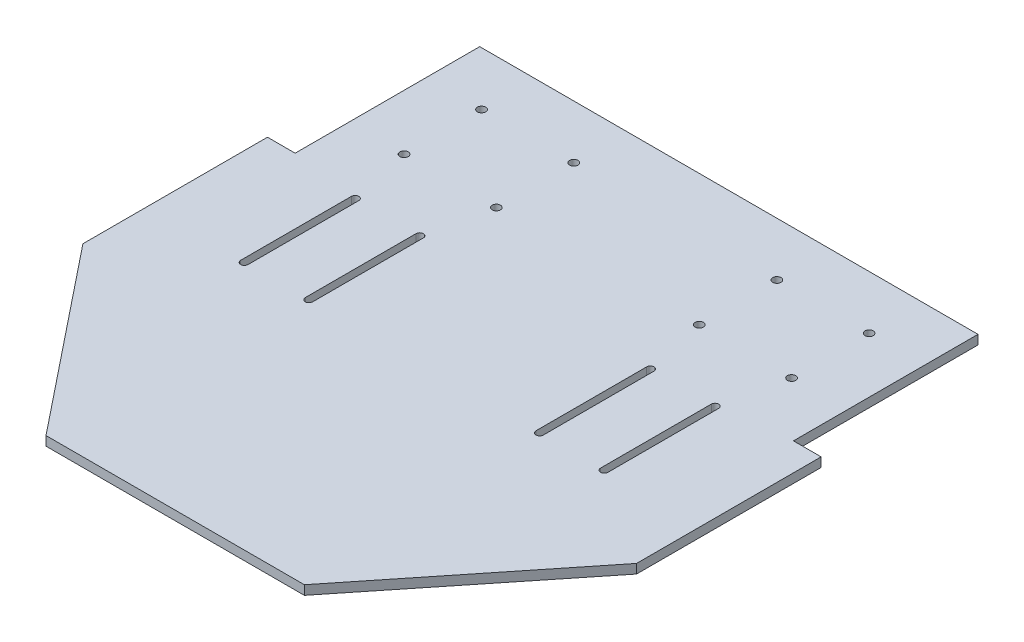
ISO-10303-21;
HEADER;
FILE_DESCRIPTION(('STEP AP214'),'2;1');
FILE_NAME('part.step','',(''),(''),'','','');
FILE_SCHEMA(('AUTOMOTIVE_DESIGN { 1 0 10303 214 1 1 1 1 }'));
ENDSEC;
DATA;
#1=APPLICATION_CONTEXT('core data for automotive mechanical design processes');
#2=APPLICATION_PROTOCOL_DEFINITION('international standard','automotive_design',2000,#1);
#3=PRODUCT_CONTEXT('',#1,'mechanical');
#4=PRODUCT('Part','Part','',(#3));
#5=PRODUCT_RELATED_PRODUCT_CATEGORY('part','',(#4));
#6=PRODUCT_DEFINITION_FORMATION('','',#4);
#7=PRODUCT_DEFINITION_CONTEXT('part definition',#1,'design');
#8=PRODUCT_DEFINITION('design','',#6,#7);
#9=PRODUCT_DEFINITION_SHAPE('','',#8);
#10=(LENGTH_UNIT() NAMED_UNIT(*) SI_UNIT(.MILLI.,.METRE.));
#11=(NAMED_UNIT(*) PLANE_ANGLE_UNIT() SI_UNIT($,.RADIAN.));
#12=(NAMED_UNIT(*) SI_UNIT($,.STERADIAN.) SOLID_ANGLE_UNIT());
#13=UNCERTAINTY_MEASURE_WITH_UNIT(LENGTH_MEASURE(1.E-05),#10,'distance_accuracy_value','');
#14=(GEOMETRIC_REPRESENTATION_CONTEXT(3) GLOBAL_UNCERTAINTY_ASSIGNED_CONTEXT((#13)) GLOBAL_UNIT_ASSIGNED_CONTEXT((#10,
#11,#12)) REPRESENTATION_CONTEXT('',''));
#15=CARTESIAN_POINT('',(0.,0.,0.));
#16=DIRECTION('',(0.,0.,1.));
#17=DIRECTION('',(1.,0.,0.));
#18=AXIS2_PLACEMENT_3D('',#15,#16,#17);
#19=CARTESIAN_POINT('',(0.,5.,0.));
#20=DIRECTION('',(0.,1.,0.));
#21=DIRECTION('',(0.,0.,1.));
#22=AXIS2_PLACEMENT_3D('',#19,#20,#21);
#23=PLANE('',#22);
#24=CARTESIAN_POINT('',(-62.5,5.,-45.));
#25=DIRECTION('',(0.,1.,0.));
#26=DIRECTION('',(0.,0.,-1.));
#27=AXIS2_PLACEMENT_3D('',#24,#25,#26);
#28=CIRCLE('',#27,2.00000000000003);
#29=CARTESIAN_POINT('',(-60.5,5.,-45.));
#30=VERTEX_POINT('',#29);
#31=CARTESIAN_POINT('',(-64.5,5.,-45.));
#32=VERTEX_POINT('',#31);
#33=EDGE_CURVE('E50',#30,#32,#28,.T.);
#34=ORIENTED_EDGE('',*,*,#33,.F.);
#35=DIRECTION('',(0.,0.,-1.));
#36=VECTOR('',#35,1.);
#37=CARTESIAN_POINT('',(-60.5,5.,-45.));
#38=LINE('',#37,#36);
#39=CARTESIAN_POINT('',(-60.5,5.,15.));
#40=VERTEX_POINT('',#39);
#41=EDGE_CURVE('E229',#40,#30,#38,.T.);
#42=ORIENTED_EDGE('',*,*,#41,.F.);
#43=CARTESIAN_POINT('',(-62.5,5.,15.));
#44=DIRECTION('',(0.,1.,0.));
#45=DIRECTION('',(0.,0.,-1.));
#46=AXIS2_PLACEMENT_3D('',#43,#44,#45);
#47=CIRCLE('',#46,2.00000000000002);
#48=CARTESIAN_POINT('',(-64.5,5.,15.));
#49=VERTEX_POINT('',#48);
#50=EDGE_CURVE('E232',#49,#40,#47,.T.);
#51=ORIENTED_EDGE('',*,*,#50,.F.);
#52=DIRECTION('',(0.,0.,1.));
#53=VECTOR('',#52,1.);
#54=CARTESIAN_POINT('',(-64.5,5.,-45.));
#55=LINE('',#54,#53);
#56=EDGE_CURVE('E238',#32,#49,#55,.T.);
#57=ORIENTED_EDGE('',*,*,#56,.F.);
#58=EDGE_LOOP('',(#34,#42,#51,#57));
#59=FACE_BOUND('',#58,.T.);
#60=CARTESIAN_POINT('',(97.5,5.,-45.));
#61=DIRECTION('',(0.,1.,0.));
#62=DIRECTION('',(0.,0.,-1.));
#63=AXIS2_PLACEMENT_3D('',#60,#61,#62);
#64=CIRCLE('',#63,2.00000000000003);
#65=CARTESIAN_POINT('',(99.5,5.,-45.));
#66=VERTEX_POINT('',#65);
#67=CARTESIAN_POINT('',(95.5,5.,-45.));
#68=VERTEX_POINT('',#67);
#69=EDGE_CURVE('E58',#66,#68,#64,.T.);
#70=ORIENTED_EDGE('',*,*,#69,.F.);
#71=DIRECTION('',(0.,0.,-1.));
#72=VECTOR('',#71,1.);
#73=CARTESIAN_POINT('',(99.5,5.,-45.));
#74=LINE('',#73,#72);
#75=CARTESIAN_POINT('',(99.5,5.,15.));
#76=VERTEX_POINT('',#75);
#77=EDGE_CURVE('E253',#76,#66,#74,.T.);
#78=ORIENTED_EDGE('',*,*,#77,.F.);
#79=CARTESIAN_POINT('',(97.5,5.,15.));
#80=DIRECTION('',(0.,1.,0.));
#81=DIRECTION('',(0.,0.,-1.));
#82=AXIS2_PLACEMENT_3D('',#79,#80,#81);
#83=CIRCLE('',#82,2.00000000000002);
#84=CARTESIAN_POINT('',(95.5,5.,15.));
#85=VERTEX_POINT('',#84);
#86=EDGE_CURVE('E268',#85,#76,#83,.T.);
#87=ORIENTED_EDGE('',*,*,#86,.F.);
#88=DIRECTION('',(0.,0.,1.));
#89=VECTOR('',#88,1.);
#90=CARTESIAN_POINT('',(95.5,5.,-45.));
#91=LINE('',#90,#89);
#92=EDGE_CURVE('E264',#68,#85,#91,.T.);
#93=ORIENTED_EDGE('',*,*,#92,.F.);
#94=EDGE_LOOP('',(#70,#78,#87,#93));
#95=FACE_BOUND('',#94,.T.);
#96=CARTESIAN_POINT('',(62.5,5.,-45.));
#97=DIRECTION('',(0.,1.,0.));
#98=DIRECTION('',(0.,0.,1.));
#99=AXIS2_PLACEMENT_3D('',#96,#97,#98);
#100=CIRCLE('',#99,2.00000000000003);
#101=CARTESIAN_POINT('',(64.5,5.,-45.));
#102=VERTEX_POINT('',#101);
#103=CARTESIAN_POINT('',(60.5,5.,-45.));
#104=VERTEX_POINT('',#103);
#105=EDGE_CURVE('E293',#102,#104,#100,.T.);
#106=ORIENTED_EDGE('',*,*,#105,.F.);
#107=DIRECTION('',(0.,0.,-1.));
#108=VECTOR('',#107,1.);
#109=CARTESIAN_POINT('',(64.5,5.,-45.));
#110=LINE('',#109,#108);
#111=CARTESIAN_POINT('',(64.5,5.,15.));
#112=VERTEX_POINT('',#111);
#113=EDGE_CURVE('E283',#112,#102,#110,.T.);
#114=ORIENTED_EDGE('',*,*,#113,.F.);
#115=CARTESIAN_POINT('',(62.5,5.,15.));
#116=DIRECTION('',(0.,1.,0.));
#117=DIRECTION('',(0.,0.,1.));
#118=AXIS2_PLACEMENT_3D('',#115,#116,#117);
#119=CIRCLE('',#118,2.00000000000002);
#120=CARTESIAN_POINT('',(60.5,5.,15.));
#121=VERTEX_POINT('',#120);
#122=EDGE_CURVE('E298',#121,#112,#119,.T.);
#123=ORIENTED_EDGE('',*,*,#122,.F.);
#124=DIRECTION('',(0.,0.,1.));
#125=VECTOR('',#124,1.);
#126=CARTESIAN_POINT('',(60.5,5.,-45.));
#127=LINE('',#126,#125);
#128=EDGE_CURVE('E295',#104,#121,#127,.T.);
#129=ORIENTED_EDGE('',*,*,#128,.F.);
#130=EDGE_LOOP('',(#106,#114,#123,#129));
#131=FACE_BOUND('',#130,.T.);
#132=CARTESIAN_POINT('',(-97.5,5.,-45.));
#133=DIRECTION('',(0.,1.,0.));
#134=DIRECTION('',(0.,0.,1.));
#135=AXIS2_PLACEMENT_3D('',#132,#133,#134);
#136=CIRCLE('',#135,2.00000000000003);
#137=CARTESIAN_POINT('',(-95.5,5.,-45.));
#138=VERTEX_POINT('',#137);
#139=CARTESIAN_POINT('',(-99.5,5.,-45.));
#140=VERTEX_POINT('',#139);
#141=EDGE_CURVE('E245',#138,#140,#136,.T.);
#142=ORIENTED_EDGE('',*,*,#141,.F.);
#143=DIRECTION('',(0.,0.,-1.));
#144=VECTOR('',#143,1.);
#145=CARTESIAN_POINT('',(-95.5,5.,-45.));
#146=LINE('',#145,#144);
#147=CARTESIAN_POINT('',(-95.5,5.,15.));
#148=VERTEX_POINT('',#147);
#149=EDGE_CURVE('E314',#148,#138,#146,.T.);
#150=ORIENTED_EDGE('',*,*,#149,.F.);
#151=CARTESIAN_POINT('',(-97.5,5.,15.));
#152=DIRECTION('',(0.,1.,0.));
#153=DIRECTION('',(0.,0.,1.));
#154=AXIS2_PLACEMENT_3D('',#151,#152,#153);
#155=CIRCLE('',#154,2.00000000000002);
#156=CARTESIAN_POINT('',(-99.5,5.,15.));
#157=VERTEX_POINT('',#156);
#158=EDGE_CURVE('E328',#157,#148,#155,.T.);
#159=ORIENTED_EDGE('',*,*,#158,.F.);
#160=DIRECTION('',(0.,0.,1.));
#161=VECTOR('',#160,1.);
#162=CARTESIAN_POINT('',(-99.5,5.,-45.));
#163=LINE('',#162,#161);
#164=EDGE_CURVE('E325',#140,#157,#163,.T.);
#165=ORIENTED_EDGE('',*,*,#164,.F.);
#166=EDGE_LOOP('',(#142,#150,#159,#165));
#167=FACE_BOUND('',#166,.T.);
#168=DIRECTION('',(1.,0.,0.));
#169=VECTOR('',#168,1.);
#170=CARTESIAN_POINT('',(150.,5.,-50.));
#171=LINE('',#170,#169);
#172=CARTESIAN_POINT('',(135.,5.,-50.));
#173=VERTEX_POINT('',#172);
#174=CARTESIAN_POINT('',(150.,5.,-50.));
#175=VERTEX_POINT('',#174);
#176=EDGE_CURVE('E346',#173,#175,#171,.T.);
#177=ORIENTED_EDGE('',*,*,#176,.F.);
#178=DIRECTION('',(0.,0.,1.));
#179=VECTOR('',#178,1.);
#180=CARTESIAN_POINT('',(135.,5.,-150.));
#181=LINE('',#180,#179);
#182=CARTESIAN_POINT('',(135.,5.,-150.));
#183=VERTEX_POINT('',#182);
#184=EDGE_CURVE('E335',#183,#173,#181,.T.);
#185=ORIENTED_EDGE('',*,*,#184,.F.);
#186=DIRECTION('',(-1.,0.,0.));
#187=VECTOR('',#186,1.);
#188=CARTESIAN_POINT('',(-150.,5.,-150.));
#189=LINE('',#188,#187);
#190=CARTESIAN_POINT('',(-135.,5.,-150.));
#191=VERTEX_POINT('',#190);
#192=EDGE_CURVE('E439',#183,#191,#189,.T.);
#193=ORIENTED_EDGE('',*,*,#192,.T.);
#194=DIRECTION('',(0.,0.,-1.));
#195=VECTOR('',#194,1.);
#196=CARTESIAN_POINT('',(-135.,5.,-150.));
#197=LINE('',#196,#195);
#198=CARTESIAN_POINT('',(-135.,5.,-50.));
#199=VERTEX_POINT('',#198);
#200=EDGE_CURVE('E364',#199,#191,#197,.T.);
#201=ORIENTED_EDGE('',*,*,#200,.F.);
#202=DIRECTION('',(1.,0.,0.));
#203=VECTOR('',#202,1.);
#204=CARTESIAN_POINT('',(-150.,5.,-50.));
#205=LINE('',#204,#203);
#206=CARTESIAN_POINT('',(-150.,5.,-50.));
#207=VERTEX_POINT('',#206);
#208=EDGE_CURVE('E356',#207,#199,#205,.T.);
#209=ORIENTED_EDGE('',*,*,#208,.F.);
#210=DIRECTION('',(0.,0.,1.));
#211=VECTOR('',#210,1.);
#212=CARTESIAN_POINT('',(-150.,5.,-150.));
#213=LINE('',#212,#211);
#214=CARTESIAN_POINT('',(-150.,5.,50.));
#215=VERTEX_POINT('',#214);
#216=EDGE_CURVE('E427',#207,#215,#213,.T.);
#217=ORIENTED_EDGE('',*,*,#216,.T.);
#218=DIRECTION('',(0.624695047554425,0.,0.78086880944303));
#219=VECTOR('',#218,1.);
#220=CARTESIAN_POINT('',(-150.,5.,50.));
#221=LINE('',#220,#219);
#222=CARTESIAN_POINT('',(-70.,5.,150.));
#223=VERTEX_POINT('',#222);
#224=EDGE_CURVE('E429',#215,#223,#221,.T.);
#225=ORIENTED_EDGE('',*,*,#224,.T.);
#226=DIRECTION('',(1.,0.,0.));
#227=VECTOR('',#226,1.);
#228=CARTESIAN_POINT('',(-70.,5.,150.));
#229=LINE('',#228,#227);
#230=CARTESIAN_POINT('',(70.,5.,150.));
#231=VERTEX_POINT('',#230);
#232=EDGE_CURVE('E432',#223,#231,#229,.T.);
#233=ORIENTED_EDGE('',*,*,#232,.T.);
#234=DIRECTION('',(0.624695047554424,0.,-0.78086880944303));
#235=VECTOR('',#234,1.);
#236=CARTESIAN_POINT('',(150.,5.,50.));
#237=LINE('',#236,#235);
#238=CARTESIAN_POINT('',(150.,5.,50.));
#239=VERTEX_POINT('',#238);
#240=EDGE_CURVE('E434',#231,#239,#237,.T.);
#241=ORIENTED_EDGE('',*,*,#240,.T.);
#242=DIRECTION('',(0.,0.,-1.));
#243=VECTOR('',#242,1.);
#244=CARTESIAN_POINT('',(150.,5.,-150.));
#245=LINE('',#244,#243);
#246=EDGE_CURVE('E436',#239,#175,#245,.T.);
#247=ORIENTED_EDGE('',*,*,#246,.T.);
#248=EDGE_LOOP('',(#177,#185,#193,#201,#209,#217,#225,#233,#241,#247));
#249=FACE_BOUND('',#248,.T.);
#250=CARTESIAN_POINT('',(105.,5.,-121.));
#251=DIRECTION('',(0.,1.,0.));
#252=DIRECTION('',(0.,0.,1.));
#253=AXIS2_PLACEMENT_3D('',#250,#251,#252);
#254=CIRCLE('',#253,2.25000000000001);
#255=CARTESIAN_POINT('',(105.,5.,-118.75));
#256=VERTEX_POINT('',#255);
#257=EDGE_CURVE('E385',#256,#256,#254,.T.);
#258=ORIENTED_EDGE('',*,*,#257,.F.);
#259=EDGE_LOOP('',(#258));
#260=FACE_BOUND('',#259,.T.);
#261=CARTESIAN_POINT('',(55.,5.,-121.));
#262=DIRECTION('',(0.,1.,0.));
#263=DIRECTION('',(0.,0.,1.));
#264=AXIS2_PLACEMENT_3D('',#261,#262,#263);
#265=CIRCLE('',#264,2.25);
#266=CARTESIAN_POINT('',(55.,5.,-118.75));
#267=VERTEX_POINT('',#266);
#268=EDGE_CURVE('E397',#267,#267,#265,.T.);
#269=ORIENTED_EDGE('',*,*,#268,.F.);
#270=EDGE_LOOP('',(#269));
#271=FACE_BOUND('',#270,.T.);
#272=CARTESIAN_POINT('',(-55.,5.,-79.));
#273=DIRECTION('',(0.,1.,0.));
#274=DIRECTION('',(0.,0.,1.));
#275=AXIS2_PLACEMENT_3D('',#272,#273,#274);
#276=CIRCLE('',#275,2.25);
#277=CARTESIAN_POINT('',(-55.,5.,-76.75));
#278=VERTEX_POINT('',#277);
#279=EDGE_CURVE('E409',#278,#278,#276,.T.);
#280=ORIENTED_EDGE('',*,*,#279,.F.);
#281=EDGE_LOOP('',(#280));
#282=FACE_BOUND('',#281,.T.);
#283=CARTESIAN_POINT('',(-105.,5.,-121.));
#284=DIRECTION('',(0.,1.,0.));
#285=DIRECTION('',(0.,0.,1.));
#286=AXIS2_PLACEMENT_3D('',#283,#284,#285);
#287=CIRCLE('',#286,2.25000000000001);
#288=CARTESIAN_POINT('',(-105.,5.,-118.75));
#289=VERTEX_POINT('',#288);
#290=EDGE_CURVE('E421',#289,#289,#287,.T.);
#291=ORIENTED_EDGE('',*,*,#290,.F.);
#292=EDGE_LOOP('',(#291));
#293=FACE_BOUND('',#292,.T.);
#294=CARTESIAN_POINT('',(-105.,5.,-79.));
#295=DIRECTION('',(0.,1.,0.));
#296=DIRECTION('',(0.,0.,1.));
#297=AXIS2_PLACEMENT_3D('',#294,#295,#296);
#298=CIRCLE('',#297,2.25000000000001);
#299=CARTESIAN_POINT('',(-105.,5.,-76.7499999999999));
#300=VERTEX_POINT('',#299);
#301=EDGE_CURVE('E415',#300,#300,#298,.T.);
#302=ORIENTED_EDGE('',*,*,#301,.F.);
#303=EDGE_LOOP('',(#302));
#304=FACE_BOUND('',#303,.T.);
#305=CARTESIAN_POINT('',(-55.,5.,-121.));
#306=DIRECTION('',(0.,1.,0.));
#307=DIRECTION('',(0.,0.,1.));
#308=AXIS2_PLACEMENT_3D('',#305,#306,#307);
#309=CIRCLE('',#308,2.25);
#310=CARTESIAN_POINT('',(-55.,5.,-118.75));
#311=VERTEX_POINT('',#310);
#312=EDGE_CURVE('E403',#311,#311,#309,.T.);
#313=ORIENTED_EDGE('',*,*,#312,.F.);
#314=EDGE_LOOP('',(#313));
#315=FACE_BOUND('',#314,.T.);
#316=CARTESIAN_POINT('',(55.,5.,-79.));
#317=DIRECTION('',(0.,1.,0.));
#318=DIRECTION('',(0.,0.,1.));
#319=AXIS2_PLACEMENT_3D('',#316,#317,#318);
#320=CIRCLE('',#319,2.25);
#321=CARTESIAN_POINT('',(55.,5.,-76.75));
#322=VERTEX_POINT('',#321);
#323=EDGE_CURVE('E391',#322,#322,#320,.T.);
#324=ORIENTED_EDGE('',*,*,#323,.F.);
#325=EDGE_LOOP('',(#324));
#326=FACE_BOUND('',#325,.T.);
#327=CARTESIAN_POINT('',(105.,5.,-79.));
#328=DIRECTION('',(0.,1.,0.));
#329=DIRECTION('',(0.,0.,1.));
#330=AXIS2_PLACEMENT_3D('',#327,#328,#329);
#331=CIRCLE('',#330,2.25000000000001);
#332=CARTESIAN_POINT('',(105.,5.,-76.75));
#333=VERTEX_POINT('',#332);
#334=EDGE_CURVE('E379',#333,#333,#331,.T.);
#335=ORIENTED_EDGE('',*,*,#334,.F.);
#336=EDGE_LOOP('',(#335));
#337=FACE_BOUND('',#336,.T.);
#338=ADVANCED_FACE('F35',(#59,#95,#131,#167,#249,#260,#271,#282,#293,#304,#315,#326,#337),#23,.T.);
#339=CARTESIAN_POINT('',(0.,0.,0.));
#340=DIRECTION('',(0.,1.,0.));
#341=DIRECTION('',(0.,0.,1.));
#342=AXIS2_PLACEMENT_3D('',#339,#340,#341);
#343=PLANE('',#342);
#344=DIRECTION('',(0.,0.,-1.));
#345=VECTOR('',#344,1.);
#346=CARTESIAN_POINT('',(-60.5,0.,-45.));
#347=LINE('',#346,#345);
#348=CARTESIAN_POINT('',(-60.5,0.,15.));
#349=VERTEX_POINT('',#348);
#350=CARTESIAN_POINT('',(-60.5,0.,-45.));
#351=VERTEX_POINT('',#350);
#352=EDGE_CURVE('E216',#349,#351,#347,.T.);
#353=ORIENTED_EDGE('',*,*,#352,.T.);
#354=CARTESIAN_POINT('',(-62.5,0.,-45.));
#355=DIRECTION('',(0.,1.,0.));
#356=DIRECTION('',(0.,0.,-1.));
#357=AXIS2_PLACEMENT_3D('',#354,#355,#356);
#358=CIRCLE('',#357,2.00000000000003);
#359=CARTESIAN_POINT('',(-64.5,0.,-45.));
#360=VERTEX_POINT('',#359);
#361=EDGE_CURVE('E210',#351,#360,#358,.T.);
#362=ORIENTED_EDGE('',*,*,#361,.T.);
#363=DIRECTION('',(0.,0.,1.));
#364=VECTOR('',#363,1.);
#365=CARTESIAN_POINT('',(-64.5,0.,-45.));
#366=LINE('',#365,#364);
#367=CARTESIAN_POINT('',(-64.5,0.,15.));
#368=VERTEX_POINT('',#367);
#369=EDGE_CURVE('E220',#360,#368,#366,.T.);
#370=ORIENTED_EDGE('',*,*,#369,.T.);
#371=CARTESIAN_POINT('',(-62.5,0.,15.));
#372=DIRECTION('',(0.,1.,0.));
#373=DIRECTION('',(0.,0.,-1.));
#374=AXIS2_PLACEMENT_3D('',#371,#372,#373);
#375=CIRCLE('',#374,2.00000000000002);
#376=EDGE_CURVE('E224',#368,#349,#375,.T.);
#377=ORIENTED_EDGE('',*,*,#376,.T.);
#378=EDGE_LOOP('',(#353,#362,#370,#377));
#379=FACE_BOUND('',#378,.T.);
#380=DIRECTION('',(0.,0.,-1.));
#381=VECTOR('',#380,1.);
#382=CARTESIAN_POINT('',(99.5,0.,-45.));
#383=LINE('',#382,#381);
#384=CARTESIAN_POINT('',(99.5,0.,15.));
#385=VERTEX_POINT('',#384);
#386=CARTESIAN_POINT('',(99.5,0.,-45.));
#387=VERTEX_POINT('',#386);
#388=EDGE_CURVE('E259',#385,#387,#383,.T.);
#389=ORIENTED_EDGE('',*,*,#388,.T.);
#390=CARTESIAN_POINT('',(97.5,0.,-45.));
#391=DIRECTION('',(0.,1.,0.));
#392=DIRECTION('',(0.,0.,-1.));
#393=AXIS2_PLACEMENT_3D('',#390,#391,#392);
#394=CIRCLE('',#393,2.00000000000003);
#395=CARTESIAN_POINT('',(95.5,0.,-45.));
#396=VERTEX_POINT('',#395);
#397=EDGE_CURVE('E249',#387,#396,#394,.T.);
#398=ORIENTED_EDGE('',*,*,#397,.T.);
#399=DIRECTION('',(0.,0.,1.));
#400=VECTOR('',#399,1.);
#401=CARTESIAN_POINT('',(95.5,0.,-45.));
#402=LINE('',#401,#400);
#403=CARTESIAN_POINT('',(95.5,0.,15.));
#404=VERTEX_POINT('',#403);
#405=EDGE_CURVE('E252',#396,#404,#402,.T.);
#406=ORIENTED_EDGE('',*,*,#405,.T.);
#407=CARTESIAN_POINT('',(97.5,0.,15.));
#408=DIRECTION('',(0.,1.,0.));
#409=DIRECTION('',(0.,0.,-1.));
#410=AXIS2_PLACEMENT_3D('',#407,#408,#409);
#411=CIRCLE('',#410,2.00000000000002);
#412=EDGE_CURVE('E256',#404,#385,#411,.T.);
#413=ORIENTED_EDGE('',*,*,#412,.T.);
#414=EDGE_LOOP('',(#389,#398,#406,#413));
#415=FACE_BOUND('',#414,.T.);
#416=DIRECTION('',(0.,0.,-1.));
#417=VECTOR('',#416,1.);
#418=CARTESIAN_POINT('',(64.5,0.,-45.));
#419=LINE('',#418,#417);
#420=CARTESIAN_POINT('',(64.5,0.,15.));
#421=VERTEX_POINT('',#420);
#422=CARTESIAN_POINT('',(64.5,0.,-45.));
#423=VERTEX_POINT('',#422);
#424=EDGE_CURVE('E289',#421,#423,#419,.T.);
#425=ORIENTED_EDGE('',*,*,#424,.T.);
#426=CARTESIAN_POINT('',(62.5,0.,-45.));
#427=DIRECTION('',(0.,1.,0.));
#428=DIRECTION('',(0.,0.,1.));
#429=AXIS2_PLACEMENT_3D('',#426,#427,#428);
#430=CIRCLE('',#429,2.00000000000003);
#431=CARTESIAN_POINT('',(60.5,0.,-45.));
#432=VERTEX_POINT('',#431);
#433=EDGE_CURVE('E279',#423,#432,#430,.T.);
#434=ORIENTED_EDGE('',*,*,#433,.T.);
#435=DIRECTION('',(0.,0.,1.));
#436=VECTOR('',#435,1.);
#437=CARTESIAN_POINT('',(60.5,0.,-45.));
#438=LINE('',#437,#436);
#439=CARTESIAN_POINT('',(60.5,0.,15.));
#440=VERTEX_POINT('',#439);
#441=EDGE_CURVE('E282',#432,#440,#438,.T.);
#442=ORIENTED_EDGE('',*,*,#441,.T.);
#443=CARTESIAN_POINT('',(62.5,0.,15.));
#444=DIRECTION('',(0.,1.,0.));
#445=DIRECTION('',(0.,0.,1.));
#446=AXIS2_PLACEMENT_3D('',#443,#444,#445);
#447=CIRCLE('',#446,2.00000000000002);
#448=EDGE_CURVE('E286',#440,#421,#447,.T.);
#449=ORIENTED_EDGE('',*,*,#448,.T.);
#450=EDGE_LOOP('',(#425,#434,#442,#449));
#451=FACE_BOUND('',#450,.T.);
#452=DIRECTION('',(0.,0.,-1.));
#453=VECTOR('',#452,1.);
#454=CARTESIAN_POINT('',(-95.5,0.,-45.));
#455=LINE('',#454,#453);
#456=CARTESIAN_POINT('',(-95.5,0.,15.));
#457=VERTEX_POINT('',#456);
#458=CARTESIAN_POINT('',(-95.5,0.,-45.));
#459=VERTEX_POINT('',#458);
#460=EDGE_CURVE('E320',#457,#459,#455,.T.);
#461=ORIENTED_EDGE('',*,*,#460,.T.);
#462=CARTESIAN_POINT('',(-97.5,0.,-45.));
#463=DIRECTION('',(0.,1.,0.));
#464=DIRECTION('',(0.,0.,1.));
#465=AXIS2_PLACEMENT_3D('',#462,#463,#464);
#466=CIRCLE('',#465,2.00000000000003);
#467=CARTESIAN_POINT('',(-99.5,0.,-45.));
#468=VERTEX_POINT('',#467);
#469=EDGE_CURVE('E310',#459,#468,#466,.T.);
#470=ORIENTED_EDGE('',*,*,#469,.T.);
#471=DIRECTION('',(0.,0.,1.));
#472=VECTOR('',#471,1.);
#473=CARTESIAN_POINT('',(-99.5,0.,-45.));
#474=LINE('',#473,#472);
#475=CARTESIAN_POINT('',(-99.5,0.,15.));
#476=VERTEX_POINT('',#475);
#477=EDGE_CURVE('E313',#468,#476,#474,.T.);
#478=ORIENTED_EDGE('',*,*,#477,.T.);
#479=CARTESIAN_POINT('',(-97.5,0.,15.));
#480=DIRECTION('',(0.,1.,0.));
#481=DIRECTION('',(0.,0.,1.));
#482=AXIS2_PLACEMENT_3D('',#479,#480,#481);
#483=CIRCLE('',#482,2.00000000000002);
#484=EDGE_CURVE('E317',#476,#457,#483,.T.);
#485=ORIENTED_EDGE('',*,*,#484,.T.);
#486=EDGE_LOOP('',(#461,#470,#478,#485));
#487=FACE_BOUND('',#486,.T.);
#488=DIRECTION('',(0.,0.,1.));
#489=VECTOR('',#488,1.);
#490=CARTESIAN_POINT('',(135.,0.,-150.));
#491=LINE('',#490,#489);
#492=CARTESIAN_POINT('',(135.,0.,-150.));
#493=VERTEX_POINT('',#492);
#494=CARTESIAN_POINT('',(135.,0.,-50.));
#495=VERTEX_POINT('',#494);
#496=EDGE_CURVE('E342',#493,#495,#491,.T.);
#497=ORIENTED_EDGE('',*,*,#496,.T.);
#498=DIRECTION('',(1.,0.,0.));
#499=VECTOR('',#498,1.);
#500=CARTESIAN_POINT('',(150.,0.,-50.));
#501=LINE('',#500,#499);
#502=CARTESIAN_POINT('',(150.,0.,-50.));
#503=VERTEX_POINT('',#502);
#504=EDGE_CURVE('E345',#495,#503,#501,.T.);
#505=ORIENTED_EDGE('',*,*,#504,.T.);
#506=DIRECTION('',(0.,0.,-1.));
#507=VECTOR('',#506,1.);
#508=CARTESIAN_POINT('',(150.,0.,-150.));
#509=LINE('',#508,#507);
#510=CARTESIAN_POINT('',(150.,0.,50.));
#511=VERTEX_POINT('',#510);
#512=EDGE_CURVE('E449',#511,#503,#509,.T.);
#513=ORIENTED_EDGE('',*,*,#512,.F.);
#514=DIRECTION('',(0.624695047554424,0.,-0.78086880944303));
#515=VECTOR('',#514,1.);
#516=CARTESIAN_POINT('',(150.,0.,50.));
#517=LINE('',#516,#515);
#518=CARTESIAN_POINT('',(70.,0.,150.));
#519=VERTEX_POINT('',#518);
#520=EDGE_CURVE('E447',#519,#511,#517,.T.);
#521=ORIENTED_EDGE('',*,*,#520,.F.);
#522=DIRECTION('',(1.,0.,0.));
#523=VECTOR('',#522,1.);
#524=CARTESIAN_POINT('',(-70.,0.,150.));
#525=LINE('',#524,#523);
#526=CARTESIAN_POINT('',(-70.,0.,150.));
#527=VERTEX_POINT('',#526);
#528=EDGE_CURVE('E445',#527,#519,#525,.T.);
#529=ORIENTED_EDGE('',*,*,#528,.F.);
#530=DIRECTION('',(0.624695047554425,0.,0.78086880944303));
#531=VECTOR('',#530,1.);
#532=CARTESIAN_POINT('',(-150.,0.,50.));
#533=LINE('',#532,#531);
#534=CARTESIAN_POINT('',(-150.,0.,50.));
#535=VERTEX_POINT('',#534);
#536=EDGE_CURVE('E443',#535,#527,#533,.T.);
#537=ORIENTED_EDGE('',*,*,#536,.F.);
#538=DIRECTION('',(0.,0.,1.));
#539=VECTOR('',#538,1.);
#540=CARTESIAN_POINT('',(-150.,0.,-150.));
#541=LINE('',#540,#539);
#542=CARTESIAN_POINT('',(-150.,0.,-50.));
#543=VERTEX_POINT('',#542);
#544=EDGE_CURVE('E424',#543,#535,#541,.T.);
#545=ORIENTED_EDGE('',*,*,#544,.F.);
#546=DIRECTION('',(1.,0.,0.));
#547=VECTOR('',#546,1.);
#548=CARTESIAN_POINT('',(-150.,0.,-50.));
#549=LINE('',#548,#547);
#550=CARTESIAN_POINT('',(-135.,0.,-50.));
#551=VERTEX_POINT('',#550);
#552=EDGE_CURVE('E360',#543,#551,#549,.T.);
#553=ORIENTED_EDGE('',*,*,#552,.T.);
#554=DIRECTION('',(0.,0.,-1.));
#555=VECTOR('',#554,1.);
#556=CARTESIAN_POINT('',(-135.,0.,-150.));
#557=LINE('',#556,#555);
#558=CARTESIAN_POINT('',(-135.,0.,-150.));
#559=VERTEX_POINT('',#558);
#560=EDGE_CURVE('E363',#551,#559,#557,.T.);
#561=ORIENTED_EDGE('',*,*,#560,.T.);
#562=DIRECTION('',(-1.,0.,0.));
#563=VECTOR('',#562,1.);
#564=CARTESIAN_POINT('',(-150.,0.,-150.));
#565=LINE('',#564,#563);
#566=EDGE_CURVE('E430',#493,#559,#565,.T.);
#567=ORIENTED_EDGE('',*,*,#566,.F.);
#568=EDGE_LOOP('',(#497,#505,#513,#521,#529,#537,#545,#553,#561,#567));
#569=FACE_BOUND('',#568,.T.);
#570=CARTESIAN_POINT('',(-105.,0.,-121.));
#571=DIRECTION('',(0.,1.,0.));
#572=DIRECTION('',(0.,0.,1.));
#573=AXIS2_PLACEMENT_3D('',#570,#571,#572);
#574=CIRCLE('',#573,2.25000000000001);
#575=CARTESIAN_POINT('',(-105.,0.,-118.75));
#576=VERTEX_POINT('',#575);
#577=EDGE_CURVE('E418',#576,#576,#574,.T.);
#578=ORIENTED_EDGE('',*,*,#577,.T.);
#579=EDGE_LOOP('',(#578));
#580=FACE_BOUND('',#579,.T.);
#581=CARTESIAN_POINT('',(-105.,0.,-79.));
#582=DIRECTION('',(0.,1.,0.));
#583=DIRECTION('',(0.,0.,1.));
#584=AXIS2_PLACEMENT_3D('',#581,#582,#583);
#585=CIRCLE('',#584,2.25000000000001);
#586=CARTESIAN_POINT('',(-105.,0.,-76.7499999999999));
#587=VERTEX_POINT('',#586);
#588=EDGE_CURVE('E412',#587,#587,#585,.T.);
#589=ORIENTED_EDGE('',*,*,#588,.T.);
#590=EDGE_LOOP('',(#589));
#591=FACE_BOUND('',#590,.T.);
#592=CARTESIAN_POINT('',(-55.,0.,-79.));
#593=DIRECTION('',(0.,1.,0.));
#594=DIRECTION('',(0.,0.,1.));
#595=AXIS2_PLACEMENT_3D('',#592,#593,#594);
#596=CIRCLE('',#595,2.25);
#597=CARTESIAN_POINT('',(-55.,0.,-76.75));
#598=VERTEX_POINT('',#597);
#599=EDGE_CURVE('E406',#598,#598,#596,.T.);
#600=ORIENTED_EDGE('',*,*,#599,.T.);
#601=EDGE_LOOP('',(#600));
#602=FACE_BOUND('',#601,.T.);
#603=CARTESIAN_POINT('',(-55.,0.,-121.));
#604=DIRECTION('',(0.,1.,0.));
#605=DIRECTION('',(0.,0.,1.));
#606=AXIS2_PLACEMENT_3D('',#603,#604,#605);
#607=CIRCLE('',#606,2.25);
#608=CARTESIAN_POINT('',(-55.,0.,-118.75));
#609=VERTEX_POINT('',#608);
#610=EDGE_CURVE('E400',#609,#609,#607,.T.);
#611=ORIENTED_EDGE('',*,*,#610,.T.);
#612=EDGE_LOOP('',(#611));
#613=FACE_BOUND('',#612,.T.);
#614=CARTESIAN_POINT('',(55.,0.,-121.));
#615=DIRECTION('',(0.,1.,0.));
#616=DIRECTION('',(0.,0.,1.));
#617=AXIS2_PLACEMENT_3D('',#614,#615,#616);
#618=CIRCLE('',#617,2.25);
#619=CARTESIAN_POINT('',(55.,0.,-118.75));
#620=VERTEX_POINT('',#619);
#621=EDGE_CURVE('E394',#620,#620,#618,.T.);
#622=ORIENTED_EDGE('',*,*,#621,.T.);
#623=EDGE_LOOP('',(#622));
#624=FACE_BOUND('',#623,.T.);
#625=CARTESIAN_POINT('',(55.,0.,-79.));
#626=DIRECTION('',(0.,1.,0.));
#627=DIRECTION('',(0.,0.,1.));
#628=AXIS2_PLACEMENT_3D('',#625,#626,#627);
#629=CIRCLE('',#628,2.25);
#630=CARTESIAN_POINT('',(55.,0.,-76.75));
#631=VERTEX_POINT('',#630);
#632=EDGE_CURVE('E388',#631,#631,#629,.T.);
#633=ORIENTED_EDGE('',*,*,#632,.T.);
#634=EDGE_LOOP('',(#633));
#635=FACE_BOUND('',#634,.T.);
#636=CARTESIAN_POINT('',(105.,0.,-121.));
#637=DIRECTION('',(0.,1.,0.));
#638=DIRECTION('',(0.,0.,1.));
#639=AXIS2_PLACEMENT_3D('',#636,#637,#638);
#640=CIRCLE('',#639,2.25000000000001);
#641=CARTESIAN_POINT('',(105.,0.,-118.75));
#642=VERTEX_POINT('',#641);
#643=EDGE_CURVE('E382',#642,#642,#640,.T.);
#644=ORIENTED_EDGE('',*,*,#643,.T.);
#645=EDGE_LOOP('',(#644));
#646=FACE_BOUND('',#645,.T.);
#647=CARTESIAN_POINT('',(105.,0.,-79.));
#648=DIRECTION('',(0.,1.,0.));
#649=DIRECTION('',(0.,0.,1.));
#650=AXIS2_PLACEMENT_3D('',#647,#648,#649);
#651=CIRCLE('',#650,2.25000000000001);
#652=CARTESIAN_POINT('',(105.,0.,-76.75));
#653=VERTEX_POINT('',#652);
#654=EDGE_CURVE('E375',#653,#653,#651,.T.);
#655=ORIENTED_EDGE('',*,*,#654,.T.);
#656=EDGE_LOOP('',(#655));
#657=FACE_BOUND('',#656,.T.);
#658=ADVANCED_FACE('F226',(#379,#415,#451,#487,#569,#580,#591,#602,#613,#624,#635,#646,#657),
#343,.F.);
#659=CARTESIAN_POINT('',(-150.,5.,-150.));
#660=DIRECTION('',(1.,0.,0.));
#661=DIRECTION('',(0.,0.,-1.));
#662=AXIS2_PLACEMENT_3D('',#659,#660,#661);
#663=PLANE('',#662);
#664=ORIENTED_EDGE('',*,*,#216,.F.);
#665=DIRECTION('',(0.,1.,0.));
#666=VECTOR('',#665,1.);
#667=CARTESIAN_POINT('',(-150.,0.,-50.));
#668=LINE('',#667,#666);
#669=EDGE_CURVE('E367',#543,#207,#668,.T.);
#670=ORIENTED_EDGE('',*,*,#669,.F.);
#671=ORIENTED_EDGE('',*,*,#544,.T.);
#672=DIRECTION('',(0.,-1.,0.));
#673=VECTOR('',#672,1.);
#674=CARTESIAN_POINT('',(-150.,5.,50.));
#675=LINE('',#674,#673);
#676=EDGE_CURVE('E11',#215,#535,#675,.T.);
#677=ORIENTED_EDGE('',*,*,#676,.F.);
#678=EDGE_LOOP('',(#664,#670,#671,#677));
#679=FACE_BOUND('',#678,.T.);
#680=ADVANCED_FACE('F37',(#679),#663,.F.);
#681=CARTESIAN_POINT('',(-150.,5.,50.));
#682=DIRECTION('',(0.78086880944303,0.,-0.624695047554425));
#683=DIRECTION('',(-0.624695047554425,0.,-0.78086880944303));
#684=AXIS2_PLACEMENT_3D('',#681,#682,#683);
#685=PLANE('',#684);
#686=ORIENTED_EDGE('',*,*,#536,.T.);
#687=DIRECTION('',(0.,-1.,0.));
#688=VECTOR('',#687,1.);
#689=CARTESIAN_POINT('',(-70.,5.,150.));
#690=LINE('',#689,#688);
#691=EDGE_CURVE('E43',#223,#527,#690,.T.);
#692=ORIENTED_EDGE('',*,*,#691,.F.);
#693=ORIENTED_EDGE('',*,*,#224,.F.);
#694=ORIENTED_EDGE('',*,*,#676,.T.);
#695=EDGE_LOOP('',(#686,#692,#693,#694));
#696=FACE_BOUND('',#695,.T.);
#697=ADVANCED_FACE('F486',(#696),#685,.F.);
#698=CARTESIAN_POINT('',(-70.,5.,150.));
#699=DIRECTION('',(0.,0.,-1.));
#700=DIRECTION('',(-1.,0.,0.));
#701=AXIS2_PLACEMENT_3D('',#698,#699,#700);
#702=PLANE('',#701);
#703=ORIENTED_EDGE('',*,*,#528,.T.);
#704=DIRECTION('',(0.,-1.,0.));
#705=VECTOR('',#704,1.);
#706=CARTESIAN_POINT('',(70.,5.,150.));
#707=LINE('',#706,#705);
#708=EDGE_CURVE('E455',#231,#519,#707,.T.);
#709=ORIENTED_EDGE('',*,*,#708,.F.);
#710=ORIENTED_EDGE('',*,*,#232,.F.);
#711=ORIENTED_EDGE('',*,*,#691,.T.);
#712=EDGE_LOOP('',(#703,#709,#710,#711));
#713=FACE_BOUND('',#712,.T.);
#714=ADVANCED_FACE('F462',(#713),#702,.F.);
#715=CARTESIAN_POINT('',(150.,5.,50.));
#716=DIRECTION('',(-0.78086880944303,0.,-0.624695047554424));
#717=DIRECTION('',(-0.624695047554424,0.,0.78086880944303));
#718=AXIS2_PLACEMENT_3D('',#715,#716,#717);
#719=PLANE('',#718);
#720=ORIENTED_EDGE('',*,*,#520,.T.);
#721=DIRECTION('',(0.,-1.,0.));
#722=VECTOR('',#721,1.);
#723=CARTESIAN_POINT('',(150.,5.,50.));
#724=LINE('',#723,#722);
#725=EDGE_CURVE('E441',#239,#511,#724,.T.);
#726=ORIENTED_EDGE('',*,*,#725,.F.);
#727=ORIENTED_EDGE('',*,*,#240,.F.);
#728=ORIENTED_EDGE('',*,*,#708,.T.);
#729=EDGE_LOOP('',(#720,#726,#727,#728));
#730=FACE_BOUND('',#729,.T.);
#731=ADVANCED_FACE('F474',(#730),#719,.F.);
#732=CARTESIAN_POINT('',(150.,5.,-150.));
#733=DIRECTION('',(-1.,0.,0.));
#734=DIRECTION('',(0.,0.,1.));
#735=AXIS2_PLACEMENT_3D('',#732,#733,#734);
#736=PLANE('',#735);
#737=ORIENTED_EDGE('',*,*,#512,.T.);
#738=DIRECTION('',(0.,1.,0.));
#739=VECTOR('',#738,1.);
#740=CARTESIAN_POINT('',(150.,0.,-50.));
#741=LINE('',#740,#739);
#742=EDGE_CURVE('E353',#503,#175,#741,.T.);
#743=ORIENTED_EDGE('',*,*,#742,.T.);
#744=ORIENTED_EDGE('',*,*,#246,.F.);
#745=ORIENTED_EDGE('',*,*,#725,.T.);
#746=EDGE_LOOP('',(#737,#743,#744,#745));
#747=FACE_BOUND('',#746,.T.);
#748=ADVANCED_FACE('F478',(#747),#736,.F.);
#749=CARTESIAN_POINT('',(-150.,5.,-150.));
#750=DIRECTION('',(0.,0.,1.));
#751=DIRECTION('',(1.,0.,0.));
#752=AXIS2_PLACEMENT_3D('',#749,#750,#751);
#753=PLANE('',#752);
#754=ORIENTED_EDGE('',*,*,#192,.F.);
#755=DIRECTION('',(0.,1.,0.));
#756=VECTOR('',#755,1.);
#757=CARTESIAN_POINT('',(135.,0.,-150.));
#758=LINE('',#757,#756);
#759=EDGE_CURVE('E349',#493,#183,#758,.T.);
#760=ORIENTED_EDGE('',*,*,#759,.F.);
#761=ORIENTED_EDGE('',*,*,#566,.T.);
#762=DIRECTION('',(0.,1.,0.));
#763=VECTOR('',#762,1.);
#764=CARTESIAN_POINT('',(-135.,0.,-150.));
#765=LINE('',#764,#763);
#766=EDGE_CURVE('E372',#559,#191,#765,.T.);
#767=ORIENTED_EDGE('',*,*,#766,.T.);
#768=EDGE_LOOP('',(#754,#760,#761,#767));
#769=FACE_BOUND('',#768,.T.);
#770=ADVANCED_FACE('F499',(#769),#753,.F.);
#771=CARTESIAN_POINT('',(-105.,5.,-121.));
#772=DIRECTION('',(0.,-1.,0.));
#773=DIRECTION('',(0.,0.,-1.));
#774=AXIS2_PLACEMENT_3D('',#771,#772,#773);
#775=CYLINDRICAL_SURFACE('',#774,2.25000000000001);
#776=ORIENTED_EDGE('',*,*,#290,.T.);
#777=EDGE_LOOP('',(#776));
#778=FACE_BOUND('',#777,.T.);
#779=ORIENTED_EDGE('',*,*,#577,.F.);
#780=EDGE_LOOP('',(#779));
#781=FACE_BOUND('',#780,.T.);
#782=ADVANCED_FACE('F525',(#778,#781),#775,.F.);
#783=CARTESIAN_POINT('',(-105.,5.,-79.));
#784=DIRECTION('',(0.,-1.,0.));
#785=DIRECTION('',(0.,0.,-1.));
#786=AXIS2_PLACEMENT_3D('',#783,#784,#785);
#787=CYLINDRICAL_SURFACE('',#786,2.25000000000001);
#788=ORIENTED_EDGE('',*,*,#301,.T.);
#789=EDGE_LOOP('',(#788));
#790=FACE_BOUND('',#789,.T.);
#791=ORIENTED_EDGE('',*,*,#588,.F.);
#792=EDGE_LOOP('',(#791));
#793=FACE_BOUND('',#792,.T.);
#794=ADVANCED_FACE('F797',(#790,#793),#787,.F.);
#795=CARTESIAN_POINT('',(-55.,5.,-79.));
#796=DIRECTION('',(0.,-1.,0.));
#797=DIRECTION('',(0.,0.,-1.));
#798=AXIS2_PLACEMENT_3D('',#795,#796,#797);
#799=CYLINDRICAL_SURFACE('',#798,2.25);
#800=ORIENTED_EDGE('',*,*,#279,.T.);
#801=EDGE_LOOP('',(#800));
#802=FACE_BOUND('',#801,.T.);
#803=ORIENTED_EDGE('',*,*,#599,.F.);
#804=EDGE_LOOP('',(#803));
#805=FACE_BOUND('',#804,.T.);
#806=ADVANCED_FACE('F806',(#802,#805),#799,.F.);
#807=CARTESIAN_POINT('',(-55.,5.,-121.));
#808=DIRECTION('',(0.,-1.,0.));
#809=DIRECTION('',(0.,0.,-1.));
#810=AXIS2_PLACEMENT_3D('',#807,#808,#809);
#811=CYLINDRICAL_SURFACE('',#810,2.25);
#812=ORIENTED_EDGE('',*,*,#312,.T.);
#813=EDGE_LOOP('',(#812));
#814=FACE_BOUND('',#813,.T.);
#815=ORIENTED_EDGE('',*,*,#610,.F.);
#816=EDGE_LOOP('',(#815));
#817=FACE_BOUND('',#816,.T.);
#818=ADVANCED_FACE('F815',(#814,#817),#811,.F.);
#819=CARTESIAN_POINT('',(55.,5.,-121.));
#820=DIRECTION('',(0.,-1.,0.));
#821=DIRECTION('',(0.,0.,-1.));
#822=AXIS2_PLACEMENT_3D('',#819,#820,#821);
#823=CYLINDRICAL_SURFACE('',#822,2.25);
#824=ORIENTED_EDGE('',*,*,#268,.T.);
#825=EDGE_LOOP('',(#824));
#826=FACE_BOUND('',#825,.T.);
#827=ORIENTED_EDGE('',*,*,#621,.F.);
#828=EDGE_LOOP('',(#827));
#829=FACE_BOUND('',#828,.T.);
#830=ADVANCED_FACE('F825',(#826,#829),#823,.F.);
#831=CARTESIAN_POINT('',(55.,5.,-79.));
#832=DIRECTION('',(0.,-1.,0.));
#833=DIRECTION('',(0.,0.,-1.));
#834=AXIS2_PLACEMENT_3D('',#831,#832,#833);
#835=CYLINDRICAL_SURFACE('',#834,2.25);
#836=ORIENTED_EDGE('',*,*,#323,.T.);
#837=EDGE_LOOP('',(#836));
#838=FACE_BOUND('',#837,.T.);
#839=ORIENTED_EDGE('',*,*,#632,.F.);
#840=EDGE_LOOP('',(#839));
#841=FACE_BOUND('',#840,.T.);
#842=ADVANCED_FACE('F835',(#838,#841),#835,.F.);
#843=CARTESIAN_POINT('',(105.,5.,-121.));
#844=DIRECTION('',(0.,-1.,0.));
#845=DIRECTION('',(0.,0.,-1.));
#846=AXIS2_PLACEMENT_3D('',#843,#844,#845);
#847=CYLINDRICAL_SURFACE('',#846,2.25000000000001);
#848=ORIENTED_EDGE('',*,*,#257,.T.);
#849=EDGE_LOOP('',(#848));
#850=FACE_BOUND('',#849,.T.);
#851=ORIENTED_EDGE('',*,*,#643,.F.);
#852=EDGE_LOOP('',(#851));
#853=FACE_BOUND('',#852,.T.);
#854=ADVANCED_FACE('F845',(#850,#853),#847,.F.);
#855=CARTESIAN_POINT('',(105.,5.,-79.));
#856=DIRECTION('',(0.,-1.,0.));
#857=DIRECTION('',(0.,0.,-1.));
#858=AXIS2_PLACEMENT_3D('',#855,#856,#857);
#859=CYLINDRICAL_SURFACE('',#858,2.25000000000001);
#860=ORIENTED_EDGE('',*,*,#334,.T.);
#861=EDGE_LOOP('',(#860));
#862=FACE_BOUND('',#861,.T.);
#863=ORIENTED_EDGE('',*,*,#654,.F.);
#864=EDGE_LOOP('',(#863));
#865=FACE_BOUND('',#864,.T.);
#866=ADVANCED_FACE('F757',(#862,#865),#859,.F.);
#867=CARTESIAN_POINT('',(-135.,0.,-150.));
#868=DIRECTION('',(1.,0.,0.));
#869=DIRECTION('',(0.,0.,-1.));
#870=AXIS2_PLACEMENT_3D('',#867,#868,#869);
#871=PLANE('',#870);
#872=ORIENTED_EDGE('',*,*,#200,.T.);
#873=ORIENTED_EDGE('',*,*,#766,.F.);
#874=ORIENTED_EDGE('',*,*,#560,.F.);
#875=DIRECTION('',(0.,1.,0.));
#876=VECTOR('',#875,1.);
#877=CARTESIAN_POINT('',(-135.,0.,-50.));
#878=LINE('',#877,#876);
#879=EDGE_CURVE('E376',#551,#199,#878,.T.);
#880=ORIENTED_EDGE('',*,*,#879,.T.);
#881=EDGE_LOOP('',(#872,#873,#874,#880));
#882=FACE_BOUND('',#881,.T.);
#883=ADVANCED_FACE('F496',(#882),#871,.F.);
#884=CARTESIAN_POINT('',(-150.,0.,-50.));
#885=DIRECTION('',(0.,0.,1.));
#886=DIRECTION('',(1.,0.,0.));
#887=AXIS2_PLACEMENT_3D('',#884,#885,#886);
#888=PLANE('',#887);
#889=ORIENTED_EDGE('',*,*,#208,.T.);
#890=ORIENTED_EDGE('',*,*,#879,.F.);
#891=ORIENTED_EDGE('',*,*,#552,.F.);
#892=ORIENTED_EDGE('',*,*,#669,.T.);
#893=EDGE_LOOP('',(#889,#890,#891,#892));
#894=FACE_BOUND('',#893,.T.);
#895=ADVANCED_FACE('F492',(#894),#888,.F.);
#896=CARTESIAN_POINT('',(150.,0.,-50.));
#897=DIRECTION('',(0.,0.,1.));
#898=DIRECTION('',(1.,0.,0.));
#899=AXIS2_PLACEMENT_3D('',#896,#897,#898);
#900=PLANE('',#899);
#901=ORIENTED_EDGE('',*,*,#176,.T.);
#902=ORIENTED_EDGE('',*,*,#742,.F.);
#903=ORIENTED_EDGE('',*,*,#504,.F.);
#904=DIRECTION('',(0.,1.,0.));
#905=VECTOR('',#904,1.);
#906=CARTESIAN_POINT('',(135.,0.,-50.));
#907=LINE('',#906,#905);
#908=EDGE_CURVE('E357',#495,#173,#907,.T.);
#909=ORIENTED_EDGE('',*,*,#908,.T.);
#910=EDGE_LOOP('',(#901,#902,#903,#909));
#911=FACE_BOUND('',#910,.T.);
#912=ADVANCED_FACE('F505',(#911),#900,.F.);
#913=CARTESIAN_POINT('',(135.,0.,-150.));
#914=DIRECTION('',(-1.,0.,0.));
#915=DIRECTION('',(0.,0.,1.));
#916=AXIS2_PLACEMENT_3D('',#913,#914,#915);
#917=PLANE('',#916);
#918=ORIENTED_EDGE('',*,*,#184,.T.);
#919=ORIENTED_EDGE('',*,*,#908,.F.);
#920=ORIENTED_EDGE('',*,*,#496,.F.);
#921=ORIENTED_EDGE('',*,*,#759,.T.);
#922=EDGE_LOOP('',(#918,#919,#920,#921));
#923=FACE_BOUND('',#922,.T.);
#924=ADVANCED_FACE('F503',(#923),#917,.F.);
#925=CARTESIAN_POINT('',(-97.5,0.,-45.));
#926=DIRECTION('',(0.,1.,0.));
#927=DIRECTION('',(0.,0.,1.));
#928=AXIS2_PLACEMENT_3D('',#925,#926,#927);
#929=CYLINDRICAL_SURFACE('',#928,2.00000000000003);
#930=ORIENTED_EDGE('',*,*,#141,.T.);
#931=DIRECTION('',(0.,1.,0.));
#932=VECTOR('',#931,1.);
#933=CARTESIAN_POINT('',(-99.5,0.,-45.));
#934=LINE('',#933,#932);
#935=EDGE_CURVE('E323',#468,#140,#934,.T.);
#936=ORIENTED_EDGE('',*,*,#935,.F.);
#937=ORIENTED_EDGE('',*,*,#469,.F.);
#938=DIRECTION('',(0.,1.,0.));
#939=VECTOR('',#938,1.);
#940=CARTESIAN_POINT('',(-95.5,0.,-45.));
#941=LINE('',#940,#939);
#942=EDGE_CURVE('E333',#459,#138,#941,.T.);
#943=ORIENTED_EDGE('',*,*,#942,.T.);
#944=EDGE_LOOP('',(#930,#936,#937,#943));
#945=FACE_BOUND('',#944,.T.);
#946=ADVANCED_FACE('F512',(#945),#929,.F.);
#947=CARTESIAN_POINT('',(-95.5,0.,-45.));
#948=DIRECTION('',(1.,0.,0.));
#949=DIRECTION('',(0.,0.,-1.));
#950=AXIS2_PLACEMENT_3D('',#947,#948,#949);
#951=PLANE('',#950);
#952=ORIENTED_EDGE('',*,*,#149,.T.);
#953=ORIENTED_EDGE('',*,*,#942,.F.);
#954=ORIENTED_EDGE('',*,*,#460,.F.);
#955=DIRECTION('',(0.,1.,0.));
#956=VECTOR('',#955,1.);
#957=CARTESIAN_POINT('',(-95.5,0.,15.));
#958=LINE('',#957,#956);
#959=EDGE_CURVE('E336',#457,#148,#958,.T.);
#960=ORIENTED_EDGE('',*,*,#959,.T.);
#961=EDGE_LOOP('',(#952,#953,#954,#960));
#962=FACE_BOUND('',#961,.T.);
#963=ADVANCED_FACE('F560',(#962),#951,.F.);
#964=CARTESIAN_POINT('',(-97.5,0.,15.));
#965=DIRECTION('',(0.,1.,0.));
#966=DIRECTION('',(0.,0.,1.));
#967=AXIS2_PLACEMENT_3D('',#964,#965,#966);
#968=CYLINDRICAL_SURFACE('',#967,2.00000000000002);
#969=ORIENTED_EDGE('',*,*,#158,.T.);
#970=ORIENTED_EDGE('',*,*,#959,.F.);
#971=ORIENTED_EDGE('',*,*,#484,.F.);
#972=DIRECTION('',(0.,1.,0.));
#973=VECTOR('',#972,1.);
#974=CARTESIAN_POINT('',(-99.5,0.,15.));
#975=LINE('',#974,#973);
#976=EDGE_CURVE('E338',#476,#157,#975,.T.);
#977=ORIENTED_EDGE('',*,*,#976,.T.);
#978=EDGE_LOOP('',(#969,#970,#971,#977));
#979=FACE_BOUND('',#978,.T.);
#980=ADVANCED_FACE('F570',(#979),#968,.F.);
#981=CARTESIAN_POINT('',(-99.5,0.,-45.));
#982=DIRECTION('',(-1.,0.,0.));
#983=DIRECTION('',(0.,0.,1.));
#984=AXIS2_PLACEMENT_3D('',#981,#982,#983);
#985=PLANE('',#984);
#986=ORIENTED_EDGE('',*,*,#164,.T.);
#987=ORIENTED_EDGE('',*,*,#976,.F.);
#988=ORIENTED_EDGE('',*,*,#477,.F.);
#989=ORIENTED_EDGE('',*,*,#935,.T.);
#990=EDGE_LOOP('',(#986,#987,#988,#989));
#991=FACE_BOUND('',#990,.T.);
#992=ADVANCED_FACE('F580',(#991),#985,.F.);
#993=CARTESIAN_POINT('',(62.5,0.,-45.));
#994=DIRECTION('',(0.,1.,0.));
#995=DIRECTION('',(0.,0.,1.));
#996=AXIS2_PLACEMENT_3D('',#993,#994,#995);
#997=CYLINDRICAL_SURFACE('',#996,2.00000000000003);
#998=ORIENTED_EDGE('',*,*,#105,.T.);
#999=DIRECTION('',(0.,1.,0.));
#1000=VECTOR('',#999,1.);
#1001=CARTESIAN_POINT('',(60.5,0.,-45.));
#1002=LINE('',#1001,#1000);
#1003=EDGE_CURVE('E292',#432,#104,#1002,.T.);
#1004=ORIENTED_EDGE('',*,*,#1003,.F.);
#1005=ORIENTED_EDGE('',*,*,#433,.F.);
#1006=DIRECTION('',(0.,1.,0.));
#1007=VECTOR('',#1006,1.);
#1008=CARTESIAN_POINT('',(64.5,0.,-45.));
#1009=LINE('',#1008,#1007);
#1010=EDGE_CURVE('E265',#423,#102,#1009,.T.);
#1011=ORIENTED_EDGE('',*,*,#1010,.T.);
#1012=EDGE_LOOP('',(#998,#1004,#1005,#1011));
#1013=FACE_BOUND('',#1012,.T.);
#1014=ADVANCED_FACE('F590',(#1013),#997,.F.);
#1015=CARTESIAN_POINT('',(64.5,0.,-45.));
#1016=DIRECTION('',(1.,0.,0.));
#1017=DIRECTION('',(0.,0.,-1.));
#1018=AXIS2_PLACEMENT_3D('',#1015,#1016,#1017);
#1019=PLANE('',#1018);
#1020=ORIENTED_EDGE('',*,*,#113,.T.);
#1021=ORIENTED_EDGE('',*,*,#1010,.F.);
#1022=ORIENTED_EDGE('',*,*,#424,.F.);
#1023=DIRECTION('',(0.,1.,0.));
#1024=VECTOR('',#1023,1.);
#1025=CARTESIAN_POINT('',(64.5,0.,15.));
#1026=LINE('',#1025,#1024);
#1027=EDGE_CURVE('E304',#421,#112,#1026,.T.);
#1028=ORIENTED_EDGE('',*,*,#1027,.T.);
#1029=EDGE_LOOP('',(#1020,#1021,#1022,#1028));
#1030=FACE_BOUND('',#1029,.T.);
#1031=ADVANCED_FACE('F600',(#1030),#1019,.F.);
#1032=CARTESIAN_POINT('',(62.5,0.,15.));
#1033=DIRECTION('',(0.,1.,0.));
#1034=DIRECTION('',(0.,0.,1.));
#1035=AXIS2_PLACEMENT_3D('',#1032,#1033,#1034);
#1036=CYLINDRICAL_SURFACE('',#1035,2.00000000000002);
#1037=ORIENTED_EDGE('',*,*,#122,.T.);
#1038=ORIENTED_EDGE('',*,*,#1027,.F.);
#1039=ORIENTED_EDGE('',*,*,#448,.F.);
#1040=DIRECTION('',(0.,1.,0.));
#1041=VECTOR('',#1040,1.);
#1042=CARTESIAN_POINT('',(60.5,0.,15.));
#1043=LINE('',#1042,#1041);
#1044=EDGE_CURVE('E306',#440,#121,#1043,.T.);
#1045=ORIENTED_EDGE('',*,*,#1044,.T.);
#1046=EDGE_LOOP('',(#1037,#1038,#1039,#1045));
#1047=FACE_BOUND('',#1046,.T.);
#1048=ADVANCED_FACE('F610',(#1047),#1036,.F.);
#1049=CARTESIAN_POINT('',(60.5,0.,-45.));
#1050=DIRECTION('',(-1.,0.,0.));
#1051=DIRECTION('',(0.,0.,1.));
#1052=AXIS2_PLACEMENT_3D('',#1049,#1050,#1051);
#1053=PLANE('',#1052);
#1054=ORIENTED_EDGE('',*,*,#128,.T.);
#1055=ORIENTED_EDGE('',*,*,#1044,.F.);
#1056=ORIENTED_EDGE('',*,*,#441,.F.);
#1057=ORIENTED_EDGE('',*,*,#1003,.T.);
#1058=EDGE_LOOP('',(#1054,#1055,#1056,#1057));
#1059=FACE_BOUND('',#1058,.T.);
#1060=ADVANCED_FACE('F620',(#1059),#1053,.F.);
#1061=CARTESIAN_POINT('',(97.5,0.,-45.));
#1062=DIRECTION('',(0.,1.,0.));
#1063=DIRECTION('',(0.,0.,1.));
#1064=AXIS2_PLACEMENT_3D('',#1061,#1062,#1063);
#1065=CYLINDRICAL_SURFACE('',#1064,2.00000000000003);
#1066=ORIENTED_EDGE('',*,*,#69,.T.);
#1067=DIRECTION('',(0.,1.,0.));
#1068=VECTOR('',#1067,1.);
#1069=CARTESIAN_POINT('',(95.5,0.,-45.));
#1070=LINE('',#1069,#1068);
#1071=EDGE_CURVE('E262',#396,#68,#1070,.T.);
#1072=ORIENTED_EDGE('',*,*,#1071,.F.);
#1073=ORIENTED_EDGE('',*,*,#397,.F.);
#1074=DIRECTION('',(0.,1.,0.));
#1075=VECTOR('',#1074,1.);
#1076=CARTESIAN_POINT('',(99.5,0.,-45.));
#1077=LINE('',#1076,#1075);
#1078=EDGE_CURVE('E239',#387,#66,#1077,.T.);
#1079=ORIENTED_EDGE('',*,*,#1078,.T.);
#1080=EDGE_LOOP('',(#1066,#1072,#1073,#1079));
#1081=FACE_BOUND('',#1080,.T.);
#1082=ADVANCED_FACE('F630',(#1081),#1065,.F.);
#1083=CARTESIAN_POINT('',(99.5,0.,-45.));
#1084=DIRECTION('',(1.,0.,0.));
#1085=DIRECTION('',(0.,0.,-1.));
#1086=AXIS2_PLACEMENT_3D('',#1083,#1084,#1085);
#1087=PLANE('',#1086);
#1088=ORIENTED_EDGE('',*,*,#77,.T.);
#1089=ORIENTED_EDGE('',*,*,#1078,.F.);
#1090=ORIENTED_EDGE('',*,*,#388,.F.);
#1091=DIRECTION('',(0.,1.,0.));
#1092=VECTOR('',#1091,1.);
#1093=CARTESIAN_POINT('',(99.5,0.,15.));
#1094=LINE('',#1093,#1092);
#1095=EDGE_CURVE('E274',#385,#76,#1094,.T.);
#1096=ORIENTED_EDGE('',*,*,#1095,.T.);
#1097=EDGE_LOOP('',(#1088,#1089,#1090,#1096));
#1098=FACE_BOUND('',#1097,.T.);
#1099=ADVANCED_FACE('F640',(#1098),#1087,.F.);
#1100=CARTESIAN_POINT('',(97.5,0.,15.));
#1101=DIRECTION('',(0.,1.,0.));
#1102=DIRECTION('',(0.,0.,1.));
#1103=AXIS2_PLACEMENT_3D('',#1100,#1101,#1102);
#1104=CYLINDRICAL_SURFACE('',#1103,2.00000000000002);
#1105=ORIENTED_EDGE('',*,*,#86,.T.);
#1106=ORIENTED_EDGE('',*,*,#1095,.F.);
#1107=ORIENTED_EDGE('',*,*,#412,.F.);
#1108=DIRECTION('',(0.,1.,0.));
#1109=VECTOR('',#1108,1.);
#1110=CARTESIAN_POINT('',(95.5,0.,15.));
#1111=LINE('',#1110,#1109);
#1112=EDGE_CURVE('E276',#404,#85,#1111,.T.);
#1113=ORIENTED_EDGE('',*,*,#1112,.T.);
#1114=EDGE_LOOP('',(#1105,#1106,#1107,#1113));
#1115=FACE_BOUND('',#1114,.T.);
#1116=ADVANCED_FACE('F649',(#1115),#1104,.F.);
#1117=CARTESIAN_POINT('',(95.5,0.,-45.));
#1118=DIRECTION('',(-1.,0.,0.));
#1119=DIRECTION('',(0.,0.,1.));
#1120=AXIS2_PLACEMENT_3D('',#1117,#1118,#1119);
#1121=PLANE('',#1120);
#1122=ORIENTED_EDGE('',*,*,#92,.T.);
#1123=ORIENTED_EDGE('',*,*,#1112,.F.);
#1124=ORIENTED_EDGE('',*,*,#405,.F.);
#1125=ORIENTED_EDGE('',*,*,#1071,.T.);
#1126=EDGE_LOOP('',(#1122,#1123,#1124,#1125));
#1127=FACE_BOUND('',#1126,.T.);
#1128=ADVANCED_FACE('F659',(#1127),#1121,.F.);
#1129=CARTESIAN_POINT('',(-62.5,0.,-45.));
#1130=DIRECTION('',(0.,1.,0.));
#1131=DIRECTION('',(0.,0.,1.));
#1132=AXIS2_PLACEMENT_3D('',#1129,#1130,#1131);
#1133=CYLINDRICAL_SURFACE('',#1132,2.00000000000003);
#1134=ORIENTED_EDGE('',*,*,#33,.T.);
#1135=DIRECTION('',(0.,1.,0.));
#1136=VECTOR('',#1135,1.);
#1137=CARTESIAN_POINT('',(-64.5,0.,-45.));
#1138=LINE('',#1137,#1136);
#1139=EDGE_CURVE('E206',#360,#32,#1138,.T.);
#1140=ORIENTED_EDGE('',*,*,#1139,.F.);
#1141=ORIENTED_EDGE('',*,*,#361,.F.);
#1142=DIRECTION('',(0.,1.,0.));
#1143=VECTOR('',#1142,1.);
#1144=CARTESIAN_POINT('',(-60.5,0.,-45.));
#1145=LINE('',#1144,#1143);
#1146=EDGE_CURVE('E243',#351,#30,#1145,.T.);
#1147=ORIENTED_EDGE('',*,*,#1146,.T.);
#1148=EDGE_LOOP('',(#1134,#1140,#1141,#1147));
#1149=FACE_BOUND('',#1148,.T.);
#1150=ADVANCED_FACE('F208',(#1149),#1133,.F.);
#1151=CARTESIAN_POINT('',(-60.5,0.,-45.));
#1152=DIRECTION('',(1.,0.,0.));
#1153=DIRECTION('',(0.,0.,-1.));
#1154=AXIS2_PLACEMENT_3D('',#1151,#1152,#1153);
#1155=PLANE('',#1154);
#1156=ORIENTED_EDGE('',*,*,#41,.T.);
#1157=ORIENTED_EDGE('',*,*,#1146,.F.);
#1158=ORIENTED_EDGE('',*,*,#352,.F.);
#1159=DIRECTION('',(0.,1.,0.));
#1160=VECTOR('',#1159,1.);
#1161=CARTESIAN_POINT('',(-60.5,0.,15.));
#1162=LINE('',#1161,#1160);
#1163=EDGE_CURVE('E246',#349,#40,#1162,.T.);
#1164=ORIENTED_EDGE('',*,*,#1163,.T.);
#1165=EDGE_LOOP('',(#1156,#1157,#1158,#1164));
#1166=FACE_BOUND('',#1165,.T.);
#1167=ADVANCED_FACE('F678',(#1166),#1155,.F.);
#1168=CARTESIAN_POINT('',(-62.5,0.,15.));
#1169=DIRECTION('',(0.,1.,0.));
#1170=DIRECTION('',(0.,0.,1.));
#1171=AXIS2_PLACEMENT_3D('',#1168,#1169,#1170);
#1172=CYLINDRICAL_SURFACE('',#1171,2.00000000000002);
#1173=ORIENTED_EDGE('',*,*,#50,.T.);
#1174=ORIENTED_EDGE('',*,*,#1163,.F.);
#1175=ORIENTED_EDGE('',*,*,#376,.F.);
#1176=DIRECTION('',(0.,1.,0.));
#1177=VECTOR('',#1176,1.);
#1178=CARTESIAN_POINT('',(-64.5,0.,15.));
#1179=LINE('',#1178,#1177);
#1180=EDGE_CURVE('E215',#368,#49,#1179,.T.);
#1181=ORIENTED_EDGE('',*,*,#1180,.T.);
#1182=EDGE_LOOP('',(#1173,#1174,#1175,#1181));
#1183=FACE_BOUND('',#1182,.T.);
#1184=ADVANCED_FACE('F687',(#1183),#1172,.F.);
#1185=CARTESIAN_POINT('',(-64.5,0.,-45.));
#1186=DIRECTION('',(-1.,0.,0.));
#1187=DIRECTION('',(0.,0.,1.));
#1188=AXIS2_PLACEMENT_3D('',#1185,#1186,#1187);
#1189=PLANE('',#1188);
#1190=ORIENTED_EDGE('',*,*,#56,.T.);
#1191=ORIENTED_EDGE('',*,*,#1180,.F.);
#1192=ORIENTED_EDGE('',*,*,#369,.F.);
#1193=ORIENTED_EDGE('',*,*,#1139,.T.);
#1194=EDGE_LOOP('',(#1190,#1191,#1192,#1193));
#1195=FACE_BOUND('',#1194,.T.);
#1196=ADVANCED_FACE('F221',(#1195),#1189,.F.);
#1197=CLOSED_SHELL('',(#338,#658,#680,#697,#714,#731,#748,#770,#782,#794,#806,#818,#830,#842,
#854,#866,#883,#895,#912,#924,#946,#963,#980,#992,#1014,#1031,#1048,#1060,#1082,#1099,#1116,
#1128,#1150,#1167,#1184,#1196));
#1198=MANIFOLD_SOLID_BREP('B2',#1197);
#1199=ADVANCED_BREP_SHAPE_REPRESENTATION('',(#18,#1198),#14);
#1200=SHAPE_DEFINITION_REPRESENTATION(#9,#1199);
ENDSEC;
END-ISO-10303-21;
